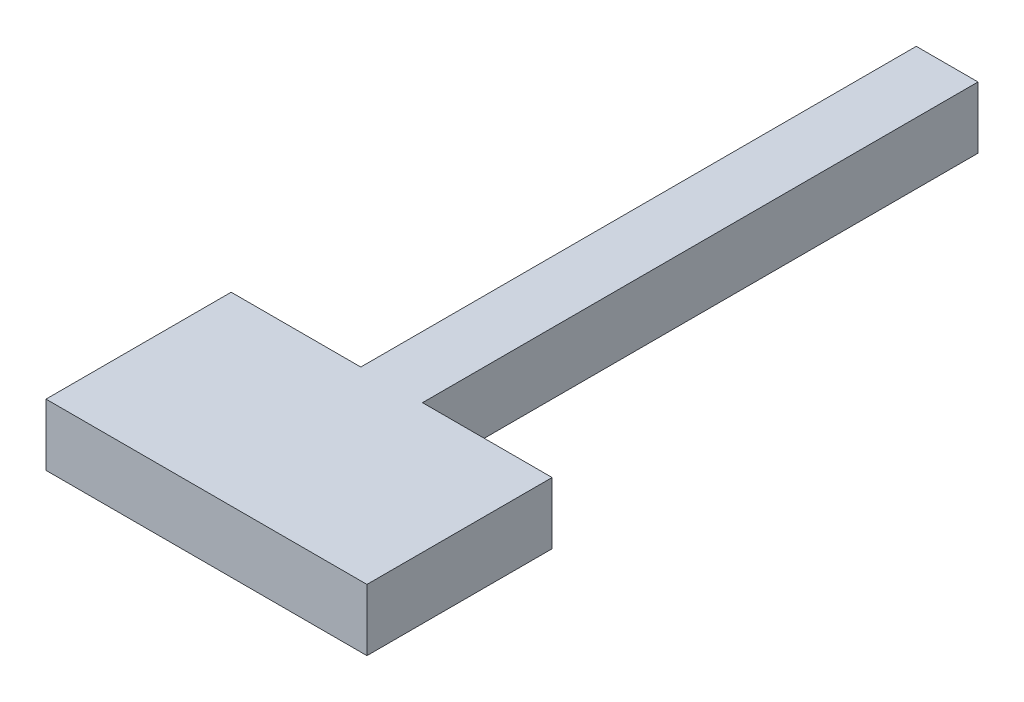
ISO-10303-21;
HEADER;
FILE_DESCRIPTION(('STEP AP214'),'2;1');
FILE_NAME('part.step','',(''),(''),'','','');
FILE_SCHEMA(('AUTOMOTIVE_DESIGN { 1 0 10303 214 1 1 1 1 }'));
ENDSEC;
DATA;
#1=APPLICATION_CONTEXT('core data for automotive mechanical design processes');
#2=APPLICATION_PROTOCOL_DEFINITION('international standard','automotive_design',2000,#1);
#3=PRODUCT_CONTEXT('',#1,'mechanical');
#4=PRODUCT('Part','Part','',(#3));
#5=PRODUCT_RELATED_PRODUCT_CATEGORY('part','',(#4));
#6=PRODUCT_DEFINITION_FORMATION('','',#4);
#7=PRODUCT_DEFINITION_CONTEXT('part definition',#1,'design');
#8=PRODUCT_DEFINITION('design','',#6,#7);
#9=PRODUCT_DEFINITION_SHAPE('','',#8);
#10=(LENGTH_UNIT() NAMED_UNIT(*) SI_UNIT(.MILLI.,.METRE.));
#11=(NAMED_UNIT(*) PLANE_ANGLE_UNIT() SI_UNIT($,.RADIAN.));
#12=(NAMED_UNIT(*) SI_UNIT($,.STERADIAN.) SOLID_ANGLE_UNIT());
#13=UNCERTAINTY_MEASURE_WITH_UNIT(LENGTH_MEASURE(1.E-05),#10,'distance_accuracy_value','');
#14=(GEOMETRIC_REPRESENTATION_CONTEXT(3) GLOBAL_UNCERTAINTY_ASSIGNED_CONTEXT((#13)) GLOBAL_UNIT_ASSIGNED_CONTEXT((#10,
#11,#12)) REPRESENTATION_CONTEXT('',''));
#15=CARTESIAN_POINT('',(0.,0.,0.));
#16=DIRECTION('',(0.,0.,1.));
#17=DIRECTION('',(1.,0.,0.));
#18=AXIS2_PLACEMENT_3D('',#15,#16,#17);
#19=CARTESIAN_POINT('',(-27.351797929377,2.72132094657053,45.));
#20=DIRECTION('',(1.,0.,0.));
#21=DIRECTION('',(0.,0.,-1.));
#22=AXIS2_PLACEMENT_3D('',#19,#20,#21);
#23=PLANE('',#22);
#24=DIRECTION('',(0.,-1.,0.));
#25=VECTOR('',#24,1.);
#26=CARTESIAN_POINT('',(-27.351797929377,2.72132094657053,0.));
#27=LINE('',#26,#25);
#28=CARTESIAN_POINT('',(-27.351797929377,7.72132094657053,0.));
#29=VERTEX_POINT('',#28);
#30=CARTESIAN_POINT('',(-27.351797929377,2.72132094657053,0.));
#31=VERTEX_POINT('',#30);
#32=EDGE_CURVE('E129',#29,#31,#27,.T.);
#33=ORIENTED_EDGE('',*,*,#32,.T.);
#34=DIRECTION('',(0.,0.,-1.));
#35=VECTOR('',#34,1.);
#36=CARTESIAN_POINT('',(-27.351797929377,2.72132094657053,45.));
#37=LINE('',#36,#35);
#38=CARTESIAN_POINT('',(-27.351797929377,2.72132094657053,45.));
#39=VERTEX_POINT('',#38);
#40=EDGE_CURVE('E11',#39,#31,#37,.T.);
#41=ORIENTED_EDGE('',*,*,#40,.F.);
#42=DIRECTION('',(0.,-1.,0.));
#43=VECTOR('',#42,1.);
#44=CARTESIAN_POINT('',(-27.351797929377,2.72132094657053,45.));
#45=LINE('',#44,#43);
#46=CARTESIAN_POINT('',(-27.351797929377,7.72132094657053,45.));
#47=VERTEX_POINT('',#46);
#48=EDGE_CURVE('E159',#47,#39,#45,.T.);
#49=ORIENTED_EDGE('',*,*,#48,.F.);
#50=DIRECTION('',(0.,0.,-1.));
#51=VECTOR('',#50,1.);
#52=CARTESIAN_POINT('',(-27.351797929377,7.72132094657053,45.));
#53=LINE('',#52,#51);
#54=EDGE_CURVE('E50',#47,#29,#53,.T.);
#55=ORIENTED_EDGE('',*,*,#54,.T.);
#56=EDGE_LOOP('',(#33,#41,#49,#55));
#57=FACE_BOUND('',#56,.T.);
#58=ADVANCED_FACE('F32',(#57),#23,.F.);
#59=CARTESIAN_POINT('',(-27.351797929377,2.72132094657053,45.));
#60=DIRECTION('',(0.,1.,0.));
#61=DIRECTION('',(0.,0.,1.));
#62=AXIS2_PLACEMENT_3D('',#59,#60,#61);
#63=PLANE('',#62);
#64=DIRECTION('',(1.,0.,0.));
#65=VECTOR('',#64,1.);
#66=CARTESIAN_POINT('',(-27.351797929377,2.72132094657053,0.));
#67=LINE('',#66,#65);
#68=CARTESIAN_POINT('',(-22.351797929377,2.72132094657053,0.));
#69=VERTEX_POINT('',#68);
#70=EDGE_CURVE('E131',#31,#69,#67,.T.);
#71=ORIENTED_EDGE('',*,*,#70,.T.);
#72=DIRECTION('',(0.,0.,-1.));
#73=VECTOR('',#72,1.);
#74=CARTESIAN_POINT('',(-22.351797929377,2.72132094657053,45.));
#75=LINE('',#74,#73);
#76=CARTESIAN_POINT('',(-22.351797929377,2.72132094657053,45.));
#77=VERTEX_POINT('',#76);
#78=EDGE_CURVE('E41',#77,#69,#75,.T.);
#79=ORIENTED_EDGE('',*,*,#78,.F.);
#80=DIRECTION('',(1.,0.,0.));
#81=VECTOR('',#80,1.);
#82=CARTESIAN_POINT('',(-37.851797929377,2.72132094657053,45.));
#83=LINE('',#82,#81);
#84=CARTESIAN_POINT('',(-11.851797929377,2.72132094657053,45.));
#85=VERTEX_POINT('',#84);
#86=EDGE_CURVE('E140',#77,#85,#83,.T.);
#87=ORIENTED_EDGE('',*,*,#86,.T.);
#88=DIRECTION('',(0.,0.,-1.));
#89=VECTOR('',#88,1.);
#90=CARTESIAN_POINT('',(-11.851797929377,2.72132094657053,60.));
#91=LINE('',#90,#89);
#92=CARTESIAN_POINT('',(-11.851797929377,2.72132094657053,60.));
#93=VERTEX_POINT('',#92);
#94=EDGE_CURVE('E147',#93,#85,#91,.T.);
#95=ORIENTED_EDGE('',*,*,#94,.F.);
#96=DIRECTION('',(1.,0.,0.));
#97=VECTOR('',#96,1.);
#98=CARTESIAN_POINT('',(-37.851797929377,2.72132094657053,60.));
#99=LINE('',#98,#97);
#100=CARTESIAN_POINT('',(-37.851797929377,2.72132094657053,60.));
#101=VERTEX_POINT('',#100);
#102=EDGE_CURVE('E120',#101,#93,#99,.T.);
#103=ORIENTED_EDGE('',*,*,#102,.F.);
#104=DIRECTION('',(0.,0.,-1.));
#105=VECTOR('',#104,1.);
#106=CARTESIAN_POINT('',(-37.851797929377,2.72132094657053,60.));
#107=LINE('',#106,#105);
#108=CARTESIAN_POINT('',(-37.851797929377,2.72132094657053,45.));
#109=VERTEX_POINT('',#108);
#110=EDGE_CURVE('E133',#101,#109,#107,.T.);
#111=ORIENTED_EDGE('',*,*,#110,.T.);
#112=EDGE_CURVE('E124',#109,#39,#83,.T.);
#113=ORIENTED_EDGE('',*,*,#112,.T.);
#114=ORIENTED_EDGE('',*,*,#40,.T.);
#115=EDGE_LOOP('',(#71,#79,#87,#95,#103,#111,#113,#114));
#116=FACE_BOUND('',#115,.T.);
#117=ADVANCED_FACE('F153',(#116),#63,.F.);
#118=CARTESIAN_POINT('',(-22.351797929377,2.72132094657053,45.));
#119=DIRECTION('',(-1.,0.,0.));
#120=DIRECTION('',(0.,0.,1.));
#121=AXIS2_PLACEMENT_3D('',#118,#119,#120);
#122=PLANE('',#121);
#123=DIRECTION('',(0.,1.,0.));
#124=VECTOR('',#123,1.);
#125=CARTESIAN_POINT('',(-22.351797929377,2.72132094657053,0.));
#126=LINE('',#125,#124);
#127=CARTESIAN_POINT('',(-22.351797929377,7.72132094657053,0.));
#128=VERTEX_POINT('',#127);
#129=EDGE_CURVE('E69',#69,#128,#126,.T.);
#130=ORIENTED_EDGE('',*,*,#129,.T.);
#131=DIRECTION('',(0.,0.,-1.));
#132=VECTOR('',#131,1.);
#133=CARTESIAN_POINT('',(-22.351797929377,7.72132094657053,45.));
#134=LINE('',#133,#132);
#135=CARTESIAN_POINT('',(-22.351797929377,7.72132094657053,45.));
#136=VERTEX_POINT('',#135);
#137=EDGE_CURVE('E179',#136,#128,#134,.T.);
#138=ORIENTED_EDGE('',*,*,#137,.F.);
#139=DIRECTION('',(0.,1.,0.));
#140=VECTOR('',#139,1.);
#141=CARTESIAN_POINT('',(-22.351797929377,2.72132094657053,45.));
#142=LINE('',#141,#140);
#143=EDGE_CURVE('E161',#77,#136,#142,.T.);
#144=ORIENTED_EDGE('',*,*,#143,.F.);
#145=ORIENTED_EDGE('',*,*,#78,.T.);
#146=EDGE_LOOP('',(#130,#138,#144,#145));
#147=FACE_BOUND('',#146,.T.);
#148=ADVANCED_FACE('F189',(#147),#122,.F.);
#149=CARTESIAN_POINT('',(-27.351797929377,7.72132094657053,45.));
#150=DIRECTION('',(0.,-1.,0.));
#151=DIRECTION('',(0.,0.,-1.));
#152=AXIS2_PLACEMENT_3D('',#149,#150,#151);
#153=PLANE('',#152);
#154=DIRECTION('',(-1.,0.,0.));
#155=VECTOR('',#154,1.);
#156=CARTESIAN_POINT('',(-27.351797929377,7.72132094657053,0.));
#157=LINE('',#156,#155);
#158=EDGE_CURVE('E72',#128,#29,#157,.T.);
#159=ORIENTED_EDGE('',*,*,#158,.T.);
#160=ORIENTED_EDGE('',*,*,#54,.F.);
#161=DIRECTION('',(-1.,0.,0.));
#162=VECTOR('',#161,1.);
#163=CARTESIAN_POINT('',(-37.851797929377,7.72132094657053,45.));
#164=LINE('',#163,#162);
#165=CARTESIAN_POINT('',(-37.851797929377,7.72132094657053,45.));
#166=VERTEX_POINT('',#165);
#167=EDGE_CURVE('E160',#47,#166,#164,.T.);
#168=ORIENTED_EDGE('',*,*,#167,.T.);
#169=DIRECTION('',(0.,0.,-1.));
#170=VECTOR('',#169,1.);
#171=CARTESIAN_POINT('',(-37.851797929377,7.72132094657053,60.));
#172=LINE('',#171,#170);
#173=CARTESIAN_POINT('',(-37.851797929377,7.72132094657053,60.));
#174=VERTEX_POINT('',#173);
#175=EDGE_CURVE('E111',#174,#166,#172,.T.);
#176=ORIENTED_EDGE('',*,*,#175,.F.);
#177=DIRECTION('',(-1.,0.,0.));
#178=VECTOR('',#177,1.);
#179=CARTESIAN_POINT('',(-37.851797929377,7.72132094657053,60.));
#180=LINE('',#179,#178);
#181=CARTESIAN_POINT('',(-11.851797929377,7.72132094657053,60.));
#182=VERTEX_POINT('',#181);
#183=EDGE_CURVE('E103',#182,#174,#180,.T.);
#184=ORIENTED_EDGE('',*,*,#183,.F.);
#185=DIRECTION('',(0.,0.,-1.));
#186=VECTOR('',#185,1.);
#187=CARTESIAN_POINT('',(-11.851797929377,7.72132094657053,60.));
#188=LINE('',#187,#186);
#189=CARTESIAN_POINT('',(-11.851797929377,7.72132094657053,45.));
#190=VERTEX_POINT('',#189);
#191=EDGE_CURVE('E108',#182,#190,#188,.T.);
#192=ORIENTED_EDGE('',*,*,#191,.T.);
#193=EDGE_CURVE('E232',#190,#136,#164,.T.);
#194=ORIENTED_EDGE('',*,*,#193,.T.);
#195=ORIENTED_EDGE('',*,*,#137,.T.);
#196=EDGE_LOOP('',(#159,#160,#168,#176,#184,#192,#194,#195));
#197=FACE_BOUND('',#196,.T.);
#198=ADVANCED_FACE('F105',(#197),#153,.F.);
#199=CARTESIAN_POINT('',(0.,0.,0.));
#200=DIRECTION('',(0.,0.,-1.));
#201=DIRECTION('',(-1.,0.,0.));
#202=AXIS2_PLACEMENT_3D('',#199,#200,#201);
#203=PLANE('',#202);
#204=CARTESIAN_POINT('',(-24.851797929377,5.22132094657053,0.));
#205=DIRECTION('',(0.,0.,-1.));
#206=DIRECTION('',(-1.,0.,0.));
#207=AXIS2_PLACEMENT_3D('',#204,#205,#206);
#208=CIRCLE('',#207,1.5);
#209=CARTESIAN_POINT('',(-26.351797929377,5.22132094657053,0.));
#210=VERTEX_POINT('',#209);
#211=EDGE_CURVE('E223',#210,#210,#208,.T.);
#212=ORIENTED_EDGE('',*,*,#211,.F.);
#213=EDGE_LOOP('',(#212));
#214=FACE_BOUND('',#213,.T.);
#215=ORIENTED_EDGE('',*,*,#32,.F.);
#216=ORIENTED_EDGE('',*,*,#158,.F.);
#217=ORIENTED_EDGE('',*,*,#129,.F.);
#218=ORIENTED_EDGE('',*,*,#70,.F.);
#219=EDGE_LOOP('',(#215,#216,#217,#218));
#220=FACE_BOUND('',#219,.T.);
#221=ADVANCED_FACE('F184',(#214,#220),#203,.T.);
#222=CARTESIAN_POINT('',(0.,0.,45.));
#223=DIRECTION('',(0.,0.,-1.));
#224=DIRECTION('',(-1.,0.,0.));
#225=AXIS2_PLACEMENT_3D('',#222,#223,#224);
#226=PLANE('',#225);
#227=ORIENTED_EDGE('',*,*,#167,.F.);
#228=ORIENTED_EDGE('',*,*,#48,.T.);
#229=ORIENTED_EDGE('',*,*,#112,.F.);
#230=DIRECTION('',(0.,-1.,0.));
#231=VECTOR('',#230,1.);
#232=CARTESIAN_POINT('',(-37.851797929377,2.72132094657053,45.));
#233=LINE('',#232,#231);
#234=EDGE_CURVE('E145',#166,#109,#233,.T.);
#235=ORIENTED_EDGE('',*,*,#234,.F.);
#236=EDGE_LOOP('',(#227,#228,#229,#235));
#237=FACE_BOUND('',#236,.T.);
#238=ADVANCED_FACE('F158',(#237),#226,.T.);
#239=CARTESIAN_POINT('',(-11.851797929377,2.72132094657053,60.));
#240=DIRECTION('',(-1.,0.,0.));
#241=DIRECTION('',(0.,0.,1.));
#242=AXIS2_PLACEMENT_3D('',#239,#240,#241);
#243=PLANE('',#242);
#244=DIRECTION('',(0.,1.,0.));
#245=VECTOR('',#244,1.);
#246=CARTESIAN_POINT('',(-11.851797929377,2.72132094657053,45.));
#247=LINE('',#246,#245);
#248=EDGE_CURVE('E128',#85,#190,#247,.T.);
#249=ORIENTED_EDGE('',*,*,#248,.T.);
#250=ORIENTED_EDGE('',*,*,#191,.F.);
#251=DIRECTION('',(0.,1.,0.));
#252=VECTOR('',#251,1.);
#253=CARTESIAN_POINT('',(-11.851797929377,2.72132094657053,60.));
#254=LINE('',#253,#252);
#255=EDGE_CURVE('E115',#93,#182,#254,.T.);
#256=ORIENTED_EDGE('',*,*,#255,.F.);
#257=ORIENTED_EDGE('',*,*,#94,.T.);
#258=EDGE_LOOP('',(#249,#250,#256,#257));
#259=FACE_BOUND('',#258,.T.);
#260=ADVANCED_FACE('F126',(#259),#243,.F.);
#261=CARTESIAN_POINT('',(-37.851797929377,2.72132094657053,60.));
#262=DIRECTION('',(1.,0.,0.));
#263=DIRECTION('',(0.,0.,-1.));
#264=AXIS2_PLACEMENT_3D('',#261,#262,#263);
#265=PLANE('',#264);
#266=ORIENTED_EDGE('',*,*,#234,.T.);
#267=ORIENTED_EDGE('',*,*,#110,.F.);
#268=DIRECTION('',(0.,-1.,0.));
#269=VECTOR('',#268,1.);
#270=CARTESIAN_POINT('',(-37.851797929377,2.72132094657053,60.));
#271=LINE('',#270,#269);
#272=EDGE_CURVE('E114',#174,#101,#271,.T.);
#273=ORIENTED_EDGE('',*,*,#272,.F.);
#274=ORIENTED_EDGE('',*,*,#175,.T.);
#275=EDGE_LOOP('',(#266,#267,#273,#274));
#276=FACE_BOUND('',#275,.T.);
#277=ADVANCED_FACE('F202',(#276),#265,.F.);
#278=CARTESIAN_POINT('',(0.,0.,60.));
#279=DIRECTION('',(0.,0.,-1.));
#280=DIRECTION('',(-1.,0.,0.));
#281=AXIS2_PLACEMENT_3D('',#278,#279,#280);
#282=PLANE('',#281);
#283=ORIENTED_EDGE('',*,*,#255,.T.);
#284=ORIENTED_EDGE('',*,*,#183,.T.);
#285=ORIENTED_EDGE('',*,*,#272,.T.);
#286=ORIENTED_EDGE('',*,*,#102,.T.);
#287=EDGE_LOOP('',(#283,#284,#285,#286));
#288=FACE_BOUND('',#287,.T.);
#289=ADVANCED_FACE('F118',(#288),#282,.F.);
#290=ORIENTED_EDGE('',*,*,#86,.F.);
#291=ORIENTED_EDGE('',*,*,#143,.T.);
#292=ORIENTED_EDGE('',*,*,#193,.F.);
#293=ORIENTED_EDGE('',*,*,#248,.F.);
#294=EDGE_LOOP('',(#290,#291,#292,#293));
#295=FACE_BOUND('',#294,.T.);
#296=ADVANCED_FACE('F205',(#295),#226,.T.);
#297=CARTESIAN_POINT('',(-24.851797929377,5.22132094657053,5.));
#298=DIRECTION('',(0.,0.,-1.));
#299=DIRECTION('',(-1.,0.,0.));
#300=AXIS2_PLACEMENT_3D('',#297,#298,#299);
#301=CYLINDRICAL_SURFACE('',#300,1.5);
#302=CARTESIAN_POINT('',(-24.851797929377,5.22132094657053,5.));
#303=DIRECTION('',(0.,0.,-1.));
#304=DIRECTION('',(-1.,0.,0.));
#305=AXIS2_PLACEMENT_3D('',#302,#303,#304);
#306=CIRCLE('',#305,1.5);
#307=CARTESIAN_POINT('',(-26.351797929377,5.22132094657053,5.));
#308=VERTEX_POINT('',#307);
#309=EDGE_CURVE('E222',#308,#308,#306,.T.);
#310=ORIENTED_EDGE('',*,*,#309,.F.);
#311=EDGE_LOOP('',(#310));
#312=FACE_BOUND('',#311,.T.);
#313=ORIENTED_EDGE('',*,*,#211,.T.);
#314=EDGE_LOOP('',(#313));
#315=FACE_BOUND('',#314,.T.);
#316=ADVANCED_FACE('F208',(#312,#315),#301,.F.);
#317=CARTESIAN_POINT('',(-24.851797929377,5.22132094657053,5.));
#318=DIRECTION('',(0.,0.,-1.));
#319=DIRECTION('',(-1.,0.,0.));
#320=AXIS2_PLACEMENT_3D('',#317,#318,#319);
#321=PLANE('',#320);
#322=ORIENTED_EDGE('',*,*,#309,.T.);
#323=EDGE_LOOP('',(#322));
#324=FACE_BOUND('',#323,.T.);
#325=ADVANCED_FACE('F214',(#324),#321,.T.);
#326=CLOSED_SHELL('',(#58,#117,#148,#198,#221,#238,#260,#277,#289,#296,#316,#325));
#327=MANIFOLD_SOLID_BREP('B2',#326);
#328=ADVANCED_BREP_SHAPE_REPRESENTATION('',(#18,#327),#14);
#329=SHAPE_DEFINITION_REPRESENTATION(#9,#328);
ENDSEC;
END-ISO-10303-21;
